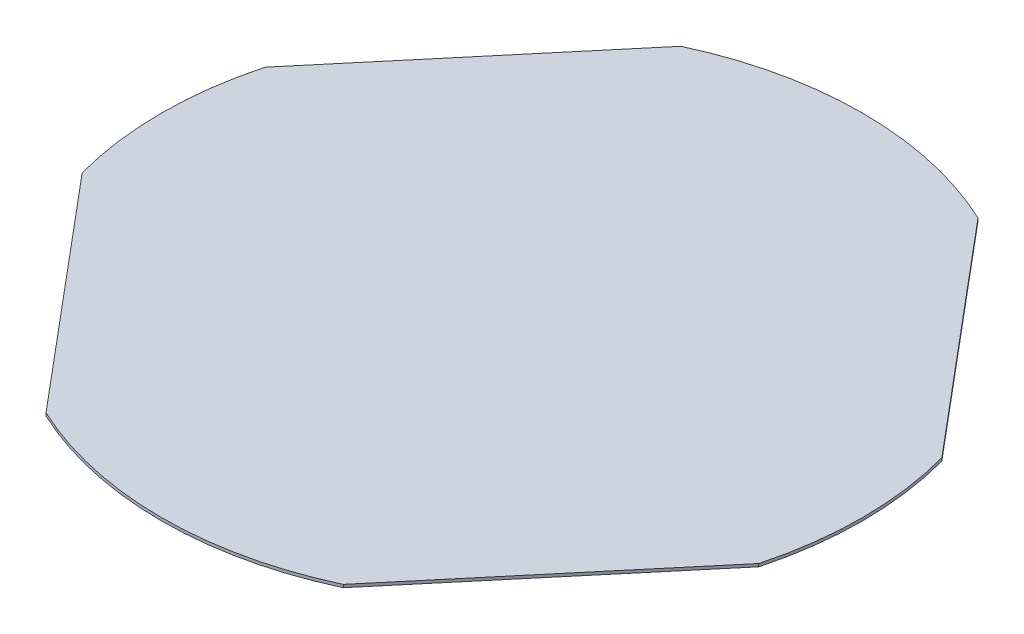
ISO-10303-21;
HEADER;
FILE_DESCRIPTION(('STEP AP214'),'2;1');
FILE_NAME('part.step','',(''),(''),'','','');
FILE_SCHEMA(('AUTOMOTIVE_DESIGN { 1 0 10303 214 1 1 1 1 }'));
ENDSEC;
DATA;
#1=APPLICATION_CONTEXT('core data for automotive mechanical design processes');
#2=APPLICATION_PROTOCOL_DEFINITION('international standard','automotive_design',2000,#1);
#3=PRODUCT_CONTEXT('',#1,'mechanical');
#4=PRODUCT('Part','Part','',(#3));
#5=PRODUCT_RELATED_PRODUCT_CATEGORY('part','',(#4));
#6=PRODUCT_DEFINITION_FORMATION('','',#4);
#7=PRODUCT_DEFINITION_CONTEXT('part definition',#1,'design');
#8=PRODUCT_DEFINITION('design','',#6,#7);
#9=PRODUCT_DEFINITION_SHAPE('','',#8);
#10=(LENGTH_UNIT() NAMED_UNIT(*) SI_UNIT(.MILLI.,.METRE.));
#11=(NAMED_UNIT(*) PLANE_ANGLE_UNIT() SI_UNIT($,.RADIAN.));
#12=(NAMED_UNIT(*) SI_UNIT($,.STERADIAN.) SOLID_ANGLE_UNIT());
#13=UNCERTAINTY_MEASURE_WITH_UNIT(LENGTH_MEASURE(1.E-05),#10,'distance_accuracy_value','');
#14=(GEOMETRIC_REPRESENTATION_CONTEXT(3) GLOBAL_UNCERTAINTY_ASSIGNED_CONTEXT((#13)) GLOBAL_UNIT_ASSIGNED_CONTEXT((#10,
#11,#12)) REPRESENTATION_CONTEXT('',''));
#15=CARTESIAN_POINT('',(0.,0.,0.));
#16=DIRECTION('',(0.,0.,1.));
#17=DIRECTION('',(1.,0.,0.));
#18=AXIS2_PLACEMENT_3D('',#15,#16,#17);
#19=CARTESIAN_POINT('',(-37.75,-0.7366,-80.5973789896421));
#20=DIRECTION('',(-0.765785918539935,0.,-0.643095581516424));
#21=DIRECTION('',(-0.643095581516424,0.,0.765785918539935));
#22=AXIS2_PLACEMENT_3D('',#19,#20,#21);
#23=PLANE('',#22);
#24=DIRECTION('',(-0.643095581516424,0.,0.765785918539935));
#25=VECTOR('',#24,1.);
#26=CARTESIAN_POINT('',(-37.75,0.,-80.5973789896421));
#27=LINE('',#26,#25);
#28=CARTESIAN_POINT('',(-37.75,0.,-80.5973789896421));
#29=VERTEX_POINT('',#28);
#30=CARTESIAN_POINT('',(-85.9094727023743,0.,-23.25));
#31=VERTEX_POINT('',#30);
#32=EDGE_CURVE('E132',#29,#31,#27,.T.);
#33=ORIENTED_EDGE('',*,*,#32,.F.);
#34=DIRECTION('',(0.,1.,0.));
#35=VECTOR('',#34,1.);
#36=CARTESIAN_POINT('',(-37.75,-0.7366,-80.5973789896421));
#37=LINE('',#36,#35);
#38=CARTESIAN_POINT('',(-37.75,-0.7366,-80.5973789896421));
#39=VERTEX_POINT('',#38);
#40=EDGE_CURVE('E11',#39,#29,#37,.T.);
#41=ORIENTED_EDGE('',*,*,#40,.F.);
#42=DIRECTION('',(-0.643095581516424,0.,0.765785918539935));
#43=VECTOR('',#42,1.);
#44=CARTESIAN_POINT('',(-37.75,-0.7366,-80.5973789896421));
#45=LINE('',#44,#43);
#46=CARTESIAN_POINT('',(-85.9094727023743,-0.7366,-23.25));
#47=VERTEX_POINT('',#46);
#48=EDGE_CURVE('E152',#39,#47,#45,.T.);
#49=ORIENTED_EDGE('',*,*,#48,.T.);
#50=DIRECTION('',(0.,1.,0.));
#51=VECTOR('',#50,1.);
#52=CARTESIAN_POINT('',(-85.9094727023743,-0.7366,-23.25));
#53=LINE('',#52,#51);
#54=EDGE_CURVE('E38',#47,#31,#53,.T.);
#55=ORIENTED_EDGE('',*,*,#54,.T.);
#56=EDGE_LOOP('',(#33,#41,#49,#55));
#57=FACE_BOUND('',#56,.T.);
#58=ADVANCED_FACE('F35',(#57),#23,.T.);
#59=CARTESIAN_POINT('',(0.,-0.7366,0.));
#60=DIRECTION('',(0.,1.,0.));
#61=DIRECTION('',(0.,0.,1.));
#62=AXIS2_PLACEMENT_3D('',#59,#60,#61);
#63=CYLINDRICAL_SURFACE('',#62,89.);
#64=CARTESIAN_POINT('',(0.,0.,0.));
#65=DIRECTION('',(0.,1.,0.));
#66=DIRECTION('',(0.,0.,1.));
#67=AXIS2_PLACEMENT_3D('',#64,#65,#66);
#68=CIRCLE('',#67,89.);
#69=CARTESIAN_POINT('',(37.75,0.,-80.5973789896421));
#70=VERTEX_POINT('',#69);
#71=EDGE_CURVE('E150',#70,#29,#68,.T.);
#72=ORIENTED_EDGE('',*,*,#71,.F.);
#73=DIRECTION('',(0.,1.,0.));
#74=VECTOR('',#73,1.);
#75=CARTESIAN_POINT('',(37.75,-0.7366,-80.5973789896421));
#76=LINE('',#75,#74);
#77=CARTESIAN_POINT('',(37.75,-0.7366,-80.5973789896421));
#78=VERTEX_POINT('',#77);
#79=EDGE_CURVE('E44',#78,#70,#76,.T.);
#80=ORIENTED_EDGE('',*,*,#79,.F.);
#81=CARTESIAN_POINT('',(0.,-0.7366,0.));
#82=DIRECTION('',(0.,1.,0.));
#83=DIRECTION('',(0.,0.,1.));
#84=AXIS2_PLACEMENT_3D('',#81,#82,#83);
#85=CIRCLE('',#84,89.);
#86=EDGE_CURVE('E122',#78,#39,#85,.T.);
#87=ORIENTED_EDGE('',*,*,#86,.T.);
#88=ORIENTED_EDGE('',*,*,#40,.T.);
#89=EDGE_LOOP('',(#72,#80,#87,#88));
#90=FACE_BOUND('',#89,.T.);
#91=ADVANCED_FACE('F164',(#90),#63,.T.);
#92=CARTESIAN_POINT('',(85.9094727023743,-0.7366,-23.25));
#93=DIRECTION('',(0.765785918539935,0.,-0.643095581516424));
#94=DIRECTION('',(-0.643095581516424,0.,-0.765785918539935));
#95=AXIS2_PLACEMENT_3D('',#92,#93,#94);
#96=PLANE('',#95);
#97=DIRECTION('',(-0.643095581516424,0.,-0.765785918539935));
#98=VECTOR('',#97,1.);
#99=CARTESIAN_POINT('',(85.9094727023743,0.,-23.25));
#100=LINE('',#99,#98);
#101=CARTESIAN_POINT('',(85.9094727023743,0.,-23.25));
#102=VERTEX_POINT('',#101);
#103=EDGE_CURVE('E109',#102,#70,#100,.T.);
#104=ORIENTED_EDGE('',*,*,#103,.F.);
#105=DIRECTION('',(0.,1.,0.));
#106=VECTOR('',#105,1.);
#107=CARTESIAN_POINT('',(85.9094727023743,-0.7366,-23.25));
#108=LINE('',#107,#106);
#109=CARTESIAN_POINT('',(85.9094727023743,-0.7366,-23.25));
#110=VERTEX_POINT('',#109);
#111=EDGE_CURVE('E104',#110,#102,#108,.T.);
#112=ORIENTED_EDGE('',*,*,#111,.F.);
#113=DIRECTION('',(-0.643095581516424,0.,-0.765785918539935));
#114=VECTOR('',#113,1.);
#115=CARTESIAN_POINT('',(85.9094727023743,-0.7366,-23.25));
#116=LINE('',#115,#114);
#117=EDGE_CURVE('E107',#110,#78,#116,.T.);
#118=ORIENTED_EDGE('',*,*,#117,.T.);
#119=ORIENTED_EDGE('',*,*,#79,.T.);
#120=EDGE_LOOP('',(#104,#112,#118,#119));
#121=FACE_BOUND('',#120,.T.);
#122=ADVANCED_FACE('F106',(#121),#96,.T.);
#123=CARTESIAN_POINT('',(0.,-0.7366,0.));
#124=DIRECTION('',(0.,1.,0.));
#125=DIRECTION('',(0.,0.,1.));
#126=AXIS2_PLACEMENT_3D('',#123,#124,#125);
#127=CYLINDRICAL_SURFACE('',#126,89.);
#128=CARTESIAN_POINT('',(0.,0.,0.));
#129=DIRECTION('',(0.,1.,0.));
#130=DIRECTION('',(0.,0.,1.));
#131=AXIS2_PLACEMENT_3D('',#128,#129,#130);
#132=CIRCLE('',#131,89.);
#133=CARTESIAN_POINT('',(85.9094727023743,0.,23.25));
#134=VERTEX_POINT('',#133);
#135=EDGE_CURVE('E147',#134,#102,#132,.T.);
#136=ORIENTED_EDGE('',*,*,#135,.F.);
#137=DIRECTION('',(0.,1.,0.));
#138=VECTOR('',#137,1.);
#139=CARTESIAN_POINT('',(85.9094727023743,-0.7366,23.25));
#140=LINE('',#139,#138);
#141=CARTESIAN_POINT('',(85.9094727023743,-0.7366,23.25));
#142=VERTEX_POINT('',#141);
#143=EDGE_CURVE('E114',#142,#134,#140,.T.);
#144=ORIENTED_EDGE('',*,*,#143,.F.);
#145=CARTESIAN_POINT('',(0.,-0.7366,0.));
#146=DIRECTION('',(0.,1.,0.));
#147=DIRECTION('',(0.,0.,1.));
#148=AXIS2_PLACEMENT_3D('',#145,#146,#147);
#149=CIRCLE('',#148,89.);
#150=EDGE_CURVE('E120',#142,#110,#149,.T.);
#151=ORIENTED_EDGE('',*,*,#150,.T.);
#152=ORIENTED_EDGE('',*,*,#111,.T.);
#153=EDGE_LOOP('',(#136,#144,#151,#152));
#154=FACE_BOUND('',#153,.T.);
#155=ADVANCED_FACE('F124',(#154),#127,.T.);
#156=CARTESIAN_POINT('',(37.75,-0.7366,80.5973789896421));
#157=DIRECTION('',(0.765785918539935,0.,0.643095581516424));
#158=DIRECTION('',(0.643095581516424,0.,-0.765785918539935));
#159=AXIS2_PLACEMENT_3D('',#156,#157,#158);
#160=PLANE('',#159);
#161=DIRECTION('',(0.643095581516424,0.,-0.765785918539935));
#162=VECTOR('',#161,1.);
#163=CARTESIAN_POINT('',(37.75,0.,80.5973789896421));
#164=LINE('',#163,#162);
#165=CARTESIAN_POINT('',(37.75,0.,80.5973789896421));
#166=VERTEX_POINT('',#165);
#167=EDGE_CURVE('E144',#166,#134,#164,.T.);
#168=ORIENTED_EDGE('',*,*,#167,.F.);
#169=DIRECTION('',(0.,1.,0.));
#170=VECTOR('',#169,1.);
#171=CARTESIAN_POINT('',(37.75,-0.7366,80.5973789896421));
#172=LINE('',#171,#170);
#173=CARTESIAN_POINT('',(37.75,-0.7366,80.5973789896421));
#174=VERTEX_POINT('',#173);
#175=EDGE_CURVE('E156',#174,#166,#172,.T.);
#176=ORIENTED_EDGE('',*,*,#175,.F.);
#177=DIRECTION('',(0.643095581516424,0.,-0.765785918539935));
#178=VECTOR('',#177,1.);
#179=CARTESIAN_POINT('',(37.75,-0.7366,80.5973789896421));
#180=LINE('',#179,#178);
#181=EDGE_CURVE('E125',#174,#142,#180,.T.);
#182=ORIENTED_EDGE('',*,*,#181,.T.);
#183=ORIENTED_EDGE('',*,*,#143,.T.);
#184=EDGE_LOOP('',(#168,#176,#182,#183));
#185=FACE_BOUND('',#184,.T.);
#186=ADVANCED_FACE('F177',(#185),#160,.T.);
#187=CARTESIAN_POINT('',(0.,-0.7366,0.));
#188=DIRECTION('',(0.,1.,0.));
#189=DIRECTION('',(0.,0.,1.));
#190=AXIS2_PLACEMENT_3D('',#187,#188,#189);
#191=CYLINDRICAL_SURFACE('',#190,89.);
#192=CARTESIAN_POINT('',(0.,0.,0.));
#193=DIRECTION('',(0.,1.,0.));
#194=DIRECTION('',(0.,0.,1.));
#195=AXIS2_PLACEMENT_3D('',#192,#193,#194);
#196=CIRCLE('',#195,89.);
#197=CARTESIAN_POINT('',(-37.75,0.,80.5973789896421));
#198=VERTEX_POINT('',#197);
#199=EDGE_CURVE('E141',#198,#166,#196,.T.);
#200=ORIENTED_EDGE('',*,*,#199,.F.);
#201=DIRECTION('',(0.,1.,0.));
#202=VECTOR('',#201,1.);
#203=CARTESIAN_POINT('',(-37.75,-0.7366,80.5973789896421));
#204=LINE('',#203,#202);
#205=CARTESIAN_POINT('',(-37.75,-0.7366,80.5973789896421));
#206=VERTEX_POINT('',#205);
#207=EDGE_CURVE('E158',#206,#198,#204,.T.);
#208=ORIENTED_EDGE('',*,*,#207,.F.);
#209=CARTESIAN_POINT('',(0.,-0.7366,0.));
#210=DIRECTION('',(0.,1.,0.));
#211=DIRECTION('',(0.,0.,1.));
#212=AXIS2_PLACEMENT_3D('',#209,#210,#211);
#213=CIRCLE('',#212,89.);
#214=EDGE_CURVE('E127',#206,#174,#213,.T.);
#215=ORIENTED_EDGE('',*,*,#214,.T.);
#216=ORIENTED_EDGE('',*,*,#175,.T.);
#217=EDGE_LOOP('',(#200,#208,#215,#216));
#218=FACE_BOUND('',#217,.T.);
#219=ADVANCED_FACE('F180',(#218),#191,.T.);
#220=CARTESIAN_POINT('',(-85.9094727023743,-0.7366,23.25));
#221=DIRECTION('',(-0.765785918539935,0.,0.643095581516424));
#222=DIRECTION('',(0.643095581516424,0.,0.765785918539935));
#223=AXIS2_PLACEMENT_3D('',#220,#221,#222);
#224=PLANE('',#223);
#225=DIRECTION('',(0.643095581516424,0.,0.765785918539935));
#226=VECTOR('',#225,1.);
#227=CARTESIAN_POINT('',(-85.9094727023743,0.,23.25));
#228=LINE('',#227,#226);
#229=CARTESIAN_POINT('',(-85.9094727023743,0.,23.25));
#230=VERTEX_POINT('',#229);
#231=EDGE_CURVE('E138',#230,#198,#228,.T.);
#232=ORIENTED_EDGE('',*,*,#231,.F.);
#233=DIRECTION('',(0.,1.,0.));
#234=VECTOR('',#233,1.);
#235=CARTESIAN_POINT('',(-85.9094727023743,-0.7366,23.25));
#236=LINE('',#235,#234);
#237=CARTESIAN_POINT('',(-85.9094727023743,-0.7366,23.25));
#238=VERTEX_POINT('',#237);
#239=EDGE_CURVE('E159',#238,#230,#236,.T.);
#240=ORIENTED_EDGE('',*,*,#239,.F.);
#241=DIRECTION('',(0.643095581516424,0.,0.765785918539935));
#242=VECTOR('',#241,1.);
#243=CARTESIAN_POINT('',(-85.9094727023743,-0.7366,23.25));
#244=LINE('',#243,#242);
#245=EDGE_CURVE('E275',#238,#206,#244,.T.);
#246=ORIENTED_EDGE('',*,*,#245,.T.);
#247=ORIENTED_EDGE('',*,*,#207,.T.);
#248=EDGE_LOOP('',(#232,#240,#246,#247));
#249=FACE_BOUND('',#248,.T.);
#250=ADVANCED_FACE('F184',(#249),#224,.T.);
#251=CARTESIAN_POINT('',(0.,-0.7366,0.));
#252=DIRECTION('',(0.,1.,0.));
#253=DIRECTION('',(0.,0.,1.));
#254=AXIS2_PLACEMENT_3D('',#251,#252,#253);
#255=CYLINDRICAL_SURFACE('',#254,89.);
#256=CARTESIAN_POINT('',(0.,0.,0.));
#257=DIRECTION('',(0.,1.,0.));
#258=DIRECTION('',(0.,0.,1.));
#259=AXIS2_PLACEMENT_3D('',#256,#257,#258);
#260=CIRCLE('',#259,89.);
#261=EDGE_CURVE('E135',#31,#230,#260,.T.);
#262=ORIENTED_EDGE('',*,*,#261,.F.);
#263=ORIENTED_EDGE('',*,*,#54,.F.);
#264=CARTESIAN_POINT('',(0.,-0.7366,0.));
#265=DIRECTION('',(0.,1.,0.));
#266=DIRECTION('',(0.,0.,1.));
#267=AXIS2_PLACEMENT_3D('',#264,#265,#266);
#268=CIRCLE('',#267,89.);
#269=EDGE_CURVE('E276',#47,#238,#268,.T.);
#270=ORIENTED_EDGE('',*,*,#269,.T.);
#271=ORIENTED_EDGE('',*,*,#239,.T.);
#272=EDGE_LOOP('',(#262,#263,#270,#271));
#273=FACE_BOUND('',#272,.T.);
#274=ADVANCED_FACE('F161',(#273),#255,.T.);
#275=CARTESIAN_POINT('',(0.,-0.7366,0.));
#276=DIRECTION('',(0.,1.,0.));
#277=DIRECTION('',(0.,0.,1.));
#278=AXIS2_PLACEMENT_3D('',#275,#276,#277);
#279=PLANE('',#278);
#280=ORIENTED_EDGE('',*,*,#48,.F.);
#281=ORIENTED_EDGE('',*,*,#86,.F.);
#282=ORIENTED_EDGE('',*,*,#117,.F.);
#283=ORIENTED_EDGE('',*,*,#150,.F.);
#284=ORIENTED_EDGE('',*,*,#181,.F.);
#285=ORIENTED_EDGE('',*,*,#214,.F.);
#286=ORIENTED_EDGE('',*,*,#245,.F.);
#287=ORIENTED_EDGE('',*,*,#269,.F.);
#288=EDGE_LOOP('',(#280,#281,#282,#283,#284,#285,#286,#287));
#289=FACE_BOUND('',#288,.T.);
#290=ADVANCED_FACE('F118',(#289),#279,.F.);
#291=CARTESIAN_POINT('',(0.,0.,0.));
#292=DIRECTION('',(0.,1.,0.));
#293=DIRECTION('',(0.,0.,1.));
#294=AXIS2_PLACEMENT_3D('',#291,#292,#293);
#295=PLANE('',#294);
#296=ORIENTED_EDGE('',*,*,#32,.T.);
#297=ORIENTED_EDGE('',*,*,#261,.T.);
#298=ORIENTED_EDGE('',*,*,#231,.T.);
#299=ORIENTED_EDGE('',*,*,#199,.T.);
#300=ORIENTED_EDGE('',*,*,#167,.T.);
#301=ORIENTED_EDGE('',*,*,#135,.T.);
#302=ORIENTED_EDGE('',*,*,#103,.T.);
#303=ORIENTED_EDGE('',*,*,#71,.T.);
#304=EDGE_LOOP('',(#296,#297,#298,#299,#300,#301,#302,#303));
#305=FACE_BOUND('',#304,.T.);
#306=ADVANCED_FACE('F163',(#305),#295,.T.);
#307=CLOSED_SHELL('',(#58,#91,#122,#155,#186,#219,#250,#274,#290,#306));
#308=MANIFOLD_SOLID_BREP('B2',#307);
#309=ADVANCED_BREP_SHAPE_REPRESENTATION('',(#18,#308),#14);
#310=SHAPE_DEFINITION_REPRESENTATION(#9,#309);
ENDSEC;
END-ISO-10303-21;
